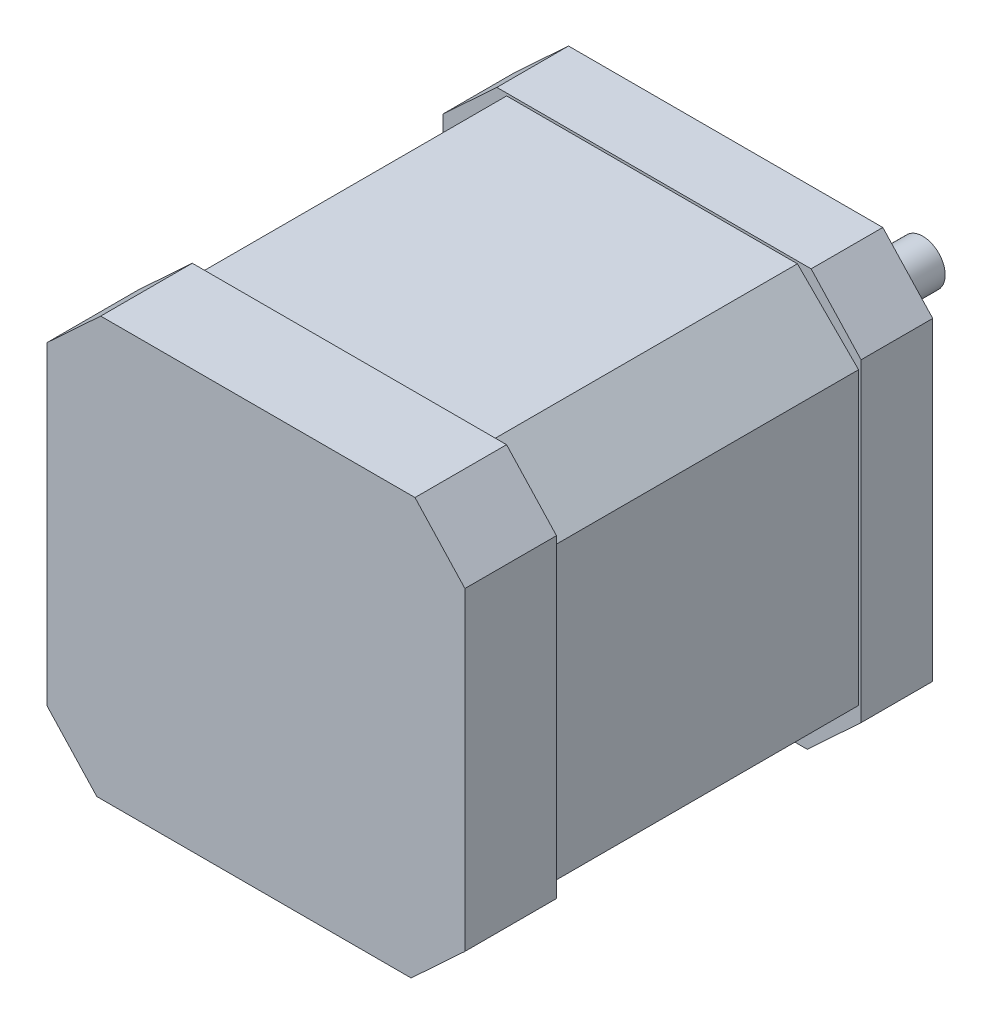
ISO-10303-21;
HEADER;
FILE_DESCRIPTION(('STEP AP214'),'2;1');
FILE_NAME('part.step','',(''),(''),'','','');
FILE_SCHEMA(('AUTOMOTIVE_DESIGN { 1 0 10303 214 1 1 1 1 }'));
ENDSEC;
DATA;
#1=APPLICATION_CONTEXT('core data for automotive mechanical design processes');
#2=APPLICATION_PROTOCOL_DEFINITION('international standard','automotive_design',2000,#1);
#3=PRODUCT_CONTEXT('',#1,'mechanical');
#4=PRODUCT('Part','Part','',(#3));
#5=PRODUCT_RELATED_PRODUCT_CATEGORY('part','',(#4));
#6=PRODUCT_DEFINITION_FORMATION('','',#4);
#7=PRODUCT_DEFINITION_CONTEXT('part definition',#1,'design');
#8=PRODUCT_DEFINITION('design','',#6,#7);
#9=PRODUCT_DEFINITION_SHAPE('','',#8);
#10=(LENGTH_UNIT() NAMED_UNIT(*) SI_UNIT(.MILLI.,.METRE.));
#11=(NAMED_UNIT(*) PLANE_ANGLE_UNIT() SI_UNIT($,.RADIAN.));
#12=(NAMED_UNIT(*) SI_UNIT($,.STERADIAN.) SOLID_ANGLE_UNIT());
#13=UNCERTAINTY_MEASURE_WITH_UNIT(LENGTH_MEASURE(1.E-05),#10,'distance_accuracy_value','');
#14=(GEOMETRIC_REPRESENTATION_CONTEXT(3) GLOBAL_UNCERTAINTY_ASSIGNED_CONTEXT((#13)) GLOBAL_UNIT_ASSIGNED_CONTEXT((#10,
#11,#12)) REPRESENTATION_CONTEXT('',''));
#15=CARTESIAN_POINT('',(0.,0.,0.));
#16=DIRECTION('',(0.,0.,1.));
#17=DIRECTION('',(1.,0.,0.));
#18=AXIS2_PLACEMENT_3D('',#15,#16,#17);
#19=CARTESIAN_POINT('',(21.,0.,47.));
#20=DIRECTION('',(1.,0.,0.));
#21=DIRECTION('',(0.,1.,0.));
#22=AXIS2_PLACEMENT_3D('',#19,#20,#21);
#23=PLANE('',#22);
#24=DIRECTION('',(0.,0.,-1.));
#25=VECTOR('',#24,1.);
#26=CARTESIAN_POINT('',(21.,-15.9841759962391,47.));
#27=LINE('',#26,#25);
#28=CARTESIAN_POINT('',(21.,-15.9841759962391,47.));
#29=VERTEX_POINT('',#28);
#30=CARTESIAN_POINT('',(21.,-15.9841759962391,37.8));
#31=VERTEX_POINT('',#30);
#32=EDGE_CURVE('E381',#29,#31,#27,.T.);
#33=ORIENTED_EDGE('',*,*,#32,.T.);
#34=DIRECTION('',(0.,1.,0.));
#35=VECTOR('',#34,1.);
#36=CARTESIAN_POINT('',(21.,0.,37.8));
#37=LINE('',#36,#35);
#38=CARTESIAN_POINT('',(21.,15.5921718725903,37.8));
#39=VERTEX_POINT('',#38);
#40=EDGE_CURVE('E108',#31,#39,#37,.T.);
#41=ORIENTED_EDGE('',*,*,#40,.T.);
#42=DIRECTION('',(0.,0.,-1.));
#43=VECTOR('',#42,1.);
#44=CARTESIAN_POINT('',(21.,15.5921718725903,47.));
#45=LINE('',#44,#43);
#46=CARTESIAN_POINT('',(21.,15.5921718725903,47.));
#47=VERTEX_POINT('',#46);
#48=EDGE_CURVE('E409',#47,#39,#45,.T.);
#49=ORIENTED_EDGE('',*,*,#48,.F.);
#50=DIRECTION('',(0.,-1.,0.));
#51=VECTOR('',#50,1.);
#52=CARTESIAN_POINT('',(21.,0.,47.));
#53=LINE('',#52,#51);
#54=EDGE_CURVE('E337',#47,#29,#53,.T.);
#55=ORIENTED_EDGE('',*,*,#54,.T.);
#56=EDGE_LOOP('',(#33,#41,#49,#55));
#57=FACE_BOUND('',#56,.T.);
#58=ADVANCED_FACE('F86',(#57),#23,.T.);
#59=CARTESIAN_POINT('',(19.0627004123154,17.6808781736177,47.));
#60=DIRECTION('',(-0.733180785089054,-0.680033775908373,0.));
#61=DIRECTION('',(0.680033775908373,-0.733180785089054,0.));
#62=AXIS2_PLACEMENT_3D('',#59,#60,#61);
#63=PLANE('',#62);
#64=DIRECTION('',(0.680033775908373,-0.733180785089054,0.));
#65=VECTOR('',#64,1.);
#66=CARTESIAN_POINT('',(19.0627004123154,17.6808781736177,37.8));
#67=LINE('',#66,#65);
#68=CARTESIAN_POINT('',(15.9841759962391,21.,37.8));
#69=VERTEX_POINT('',#68);
#70=EDGE_CURVE('E333',#69,#39,#67,.T.);
#71=ORIENTED_EDGE('',*,*,#70,.F.);
#72=DIRECTION('',(0.,0.,-1.));
#73=VECTOR('',#72,1.);
#74=CARTESIAN_POINT('',(15.9841759962391,21.,47.));
#75=LINE('',#74,#73);
#76=CARTESIAN_POINT('',(15.9841759962391,21.,47.));
#77=VERTEX_POINT('',#76);
#78=EDGE_CURVE('E405',#77,#69,#75,.T.);
#79=ORIENTED_EDGE('',*,*,#78,.F.);
#80=DIRECTION('',(-0.680033775908373,0.733180785089054,0.));
#81=VECTOR('',#80,1.);
#82=CARTESIAN_POINT('',(19.0627004123154,17.6808781736177,47.));
#83=LINE('',#82,#81);
#84=EDGE_CURVE('E340',#47,#77,#83,.T.);
#85=ORIENTED_EDGE('',*,*,#84,.F.);
#86=ORIENTED_EDGE('',*,*,#48,.T.);
#87=EDGE_LOOP('',(#71,#79,#85,#86));
#88=FACE_BOUND('',#87,.T.);
#89=ADVANCED_FACE('F481',(#88),#63,.F.);
#90=CARTESIAN_POINT('',(0.,21.,47.));
#91=DIRECTION('',(0.,1.,0.));
#92=DIRECTION('',(0.,0.,1.));
#93=AXIS2_PLACEMENT_3D('',#90,#91,#92);
#94=PLANE('',#93);
#95=ORIENTED_EDGE('',*,*,#78,.T.);
#96=DIRECTION('',(-1.,0.,0.));
#97=VECTOR('',#96,1.);
#98=CARTESIAN_POINT('',(0.,21.,37.8));
#99=LINE('',#98,#97);
#100=CARTESIAN_POINT('',(-15.5921718725903,21.,37.8));
#101=VERTEX_POINT('',#100);
#102=EDGE_CURVE('E330',#69,#101,#99,.T.);
#103=ORIENTED_EDGE('',*,*,#102,.T.);
#104=DIRECTION('',(0.,0.,-1.));
#105=VECTOR('',#104,1.);
#106=CARTESIAN_POINT('',(-15.5921718725903,21.,47.));
#107=LINE('',#106,#105);
#108=CARTESIAN_POINT('',(-15.5921718725903,21.,47.));
#109=VERTEX_POINT('',#108);
#110=EDGE_CURVE('E401',#109,#101,#107,.T.);
#111=ORIENTED_EDGE('',*,*,#110,.F.);
#112=DIRECTION('',(1.,0.,0.));
#113=VECTOR('',#112,1.);
#114=CARTESIAN_POINT('',(0.,21.,47.));
#115=LINE('',#114,#113);
#116=EDGE_CURVE('E343',#109,#77,#115,.T.);
#117=ORIENTED_EDGE('',*,*,#116,.T.);
#118=EDGE_LOOP('',(#95,#103,#111,#117));
#119=FACE_BOUND('',#118,.T.);
#120=ADVANCED_FACE('F487',(#119),#94,.T.);
#121=CARTESIAN_POINT('',(-17.6808781736177,19.0627004123154,47.));
#122=DIRECTION('',(-0.680033775908373,0.733180785089054,0.));
#123=DIRECTION('',(-0.733180785089054,-0.680033775908373,0.));
#124=AXIS2_PLACEMENT_3D('',#121,#122,#123);
#125=PLANE('',#124);
#126=ORIENTED_EDGE('',*,*,#110,.T.);
#127=DIRECTION('',(-0.733180785089054,-0.680033775908373,0.));
#128=VECTOR('',#127,1.);
#129=CARTESIAN_POINT('',(-17.6808781736177,19.0627004123154,37.8));
#130=LINE('',#129,#128);
#131=CARTESIAN_POINT('',(-21.,15.9841759962391,37.8));
#132=VERTEX_POINT('',#131);
#133=EDGE_CURVE('E327',#101,#132,#130,.T.);
#134=ORIENTED_EDGE('',*,*,#133,.T.);
#135=DIRECTION('',(0.,0.,-1.));
#136=VECTOR('',#135,1.);
#137=CARTESIAN_POINT('',(-21.,15.9841759962391,47.));
#138=LINE('',#137,#136);
#139=CARTESIAN_POINT('',(-21.,15.9841759962391,47.));
#140=VERTEX_POINT('',#139);
#141=EDGE_CURVE('E397',#140,#132,#138,.T.);
#142=ORIENTED_EDGE('',*,*,#141,.F.);
#143=DIRECTION('',(0.733180785089054,0.680033775908373,0.));
#144=VECTOR('',#143,1.);
#145=CARTESIAN_POINT('',(-17.6808781736177,19.0627004123154,47.));
#146=LINE('',#145,#144);
#147=EDGE_CURVE('E346',#140,#109,#146,.T.);
#148=ORIENTED_EDGE('',*,*,#147,.T.);
#149=EDGE_LOOP('',(#126,#134,#142,#148));
#150=FACE_BOUND('',#149,.T.);
#151=ADVANCED_FACE('F573',(#150),#125,.T.);
#152=CARTESIAN_POINT('',(-21.,0.,47.));
#153=DIRECTION('',(1.,0.,0.));
#154=DIRECTION('',(0.,1.,0.));
#155=AXIS2_PLACEMENT_3D('',#152,#153,#154);
#156=PLANE('',#155);
#157=DIRECTION('',(0.,1.,0.));
#158=VECTOR('',#157,1.);
#159=CARTESIAN_POINT('',(-21.,0.,37.8));
#160=LINE('',#159,#158);
#161=CARTESIAN_POINT('',(-21.,-15.5921718725903,37.8));
#162=VERTEX_POINT('',#161);
#163=EDGE_CURVE('E325',#162,#132,#160,.T.);
#164=ORIENTED_EDGE('',*,*,#163,.F.);
#165=DIRECTION('',(0.,0.,-1.));
#166=VECTOR('',#165,1.);
#167=CARTESIAN_POINT('',(-21.,-15.5921718725903,47.));
#168=LINE('',#167,#166);
#169=CARTESIAN_POINT('',(-21.,-15.5921718725903,47.));
#170=VERTEX_POINT('',#169);
#171=EDGE_CURVE('E393',#170,#162,#168,.T.);
#172=ORIENTED_EDGE('',*,*,#171,.F.);
#173=DIRECTION('',(0.,-1.,0.));
#174=VECTOR('',#173,1.);
#175=CARTESIAN_POINT('',(-21.,0.,47.));
#176=LINE('',#175,#174);
#177=EDGE_CURVE('E349',#140,#170,#176,.T.);
#178=ORIENTED_EDGE('',*,*,#177,.F.);
#179=ORIENTED_EDGE('',*,*,#141,.T.);
#180=EDGE_LOOP('',(#164,#172,#178,#179));
#181=FACE_BOUND('',#180,.T.);
#182=ADVANCED_FACE('F570',(#181),#156,.F.);
#183=CARTESIAN_POINT('',(-19.0627004123154,-17.6808781736177,47.));
#184=DIRECTION('',(-0.733180785089054,-0.680033775908373,0.));
#185=DIRECTION('',(0.680033775908373,-0.733180785089054,0.));
#186=AXIS2_PLACEMENT_3D('',#183,#184,#185);
#187=PLANE('',#186);
#188=ORIENTED_EDGE('',*,*,#171,.T.);
#189=DIRECTION('',(0.680033775908373,-0.733180785089054,0.));
#190=VECTOR('',#189,1.);
#191=CARTESIAN_POINT('',(-19.0627004123154,-17.6808781736177,37.8));
#192=LINE('',#191,#190);
#193=CARTESIAN_POINT('',(-15.9841759962391,-21.,37.8));
#194=VERTEX_POINT('',#193);
#195=EDGE_CURVE('E322',#162,#194,#192,.T.);
#196=ORIENTED_EDGE('',*,*,#195,.T.);
#197=DIRECTION('',(0.,0.,-1.));
#198=VECTOR('',#197,1.);
#199=CARTESIAN_POINT('',(-15.9841759962391,-21.,47.));
#200=LINE('',#199,#198);
#201=CARTESIAN_POINT('',(-15.9841759962391,-21.,47.));
#202=VERTEX_POINT('',#201);
#203=EDGE_CURVE('E389',#202,#194,#200,.T.);
#204=ORIENTED_EDGE('',*,*,#203,.F.);
#205=DIRECTION('',(-0.680033775908373,0.733180785089054,0.));
#206=VECTOR('',#205,1.);
#207=CARTESIAN_POINT('',(-19.0627004123154,-17.6808781736177,47.));
#208=LINE('',#207,#206);
#209=EDGE_CURVE('E351',#202,#170,#208,.T.);
#210=ORIENTED_EDGE('',*,*,#209,.T.);
#211=EDGE_LOOP('',(#188,#196,#204,#210));
#212=FACE_BOUND('',#211,.T.);
#213=ADVANCED_FACE('F553',(#212),#187,.T.);
#214=CARTESIAN_POINT('',(0.,-21.,47.));
#215=DIRECTION('',(0.,1.,0.));
#216=DIRECTION('',(0.,0.,1.));
#217=AXIS2_PLACEMENT_3D('',#214,#215,#216);
#218=PLANE('',#217);
#219=DIRECTION('',(-1.,0.,0.));
#220=VECTOR('',#219,1.);
#221=CARTESIAN_POINT('',(0.,-21.,37.8));
#222=LINE('',#221,#220);
#223=CARTESIAN_POINT('',(15.5921718725902,-21.,37.8));
#224=VERTEX_POINT('',#223);
#225=EDGE_CURVE('E320',#224,#194,#222,.T.);
#226=ORIENTED_EDGE('',*,*,#225,.F.);
#227=DIRECTION('',(0.,0.,-1.));
#228=VECTOR('',#227,1.);
#229=CARTESIAN_POINT('',(15.5921718725902,-21.,47.));
#230=LINE('',#229,#228);
#231=CARTESIAN_POINT('',(15.5921718725902,-21.,47.));
#232=VERTEX_POINT('',#231);
#233=EDGE_CURVE('E385',#232,#224,#230,.T.);
#234=ORIENTED_EDGE('',*,*,#233,.F.);
#235=DIRECTION('',(1.,0.,0.));
#236=VECTOR('',#235,1.);
#237=CARTESIAN_POINT('',(0.,-21.,47.));
#238=LINE('',#237,#236);
#239=EDGE_CURVE('E354',#202,#232,#238,.T.);
#240=ORIENTED_EDGE('',*,*,#239,.F.);
#241=ORIENTED_EDGE('',*,*,#203,.T.);
#242=EDGE_LOOP('',(#226,#234,#240,#241));
#243=FACE_BOUND('',#242,.T.);
#244=ADVANCED_FACE('F541',(#243),#218,.F.);
#245=CARTESIAN_POINT('',(17.6808781736177,-19.0627004123154,47.));
#246=DIRECTION('',(-0.680033775908373,0.733180785089054,0.));
#247=DIRECTION('',(-0.733180785089054,-0.680033775908373,0.));
#248=AXIS2_PLACEMENT_3D('',#245,#246,#247);
#249=PLANE('',#248);
#250=DIRECTION('',(-0.733180785089054,-0.680033775908373,0.));
#251=VECTOR('',#250,1.);
#252=CARTESIAN_POINT('',(17.6808781736177,-19.0627004123154,37.8));
#253=LINE('',#252,#251);
#254=EDGE_CURVE('E93',#31,#224,#253,.T.);
#255=ORIENTED_EDGE('',*,*,#254,.F.);
#256=ORIENTED_EDGE('',*,*,#32,.F.);
#257=DIRECTION('',(0.733180785089054,0.680033775908373,0.));
#258=VECTOR('',#257,1.);
#259=CARTESIAN_POINT('',(17.6808781736177,-19.0627004123154,47.));
#260=LINE('',#259,#258);
#261=EDGE_CURVE('E356',#232,#29,#260,.T.);
#262=ORIENTED_EDGE('',*,*,#261,.F.);
#263=ORIENTED_EDGE('',*,*,#233,.T.);
#264=EDGE_LOOP('',(#255,#256,#262,#263));
#265=FACE_BOUND('',#264,.T.);
#266=ADVANCED_FACE('F535',(#265),#249,.F.);
#267=CARTESIAN_POINT('',(0.,0.,47.));
#268=DIRECTION('',(0.,0.,1.));
#269=DIRECTION('',(1.,0.,0.));
#270=AXIS2_PLACEMENT_3D('',#267,#268,#269);
#271=PLANE('',#270);
#272=ORIENTED_EDGE('',*,*,#54,.F.);
#273=ORIENTED_EDGE('',*,*,#84,.T.);
#274=ORIENTED_EDGE('',*,*,#116,.F.);
#275=ORIENTED_EDGE('',*,*,#147,.F.);
#276=ORIENTED_EDGE('',*,*,#177,.T.);
#277=ORIENTED_EDGE('',*,*,#209,.F.);
#278=ORIENTED_EDGE('',*,*,#239,.T.);
#279=ORIENTED_EDGE('',*,*,#261,.T.);
#280=EDGE_LOOP('',(#272,#273,#274,#275,#276,#277,#278,#279));
#281=FACE_BOUND('',#280,.T.);
#282=ADVANCED_FACE('F545',(#281),#271,.T.);
#283=CARTESIAN_POINT('',(0.,0.,37.8));
#284=DIRECTION('',(0.,0.,-1.));
#285=DIRECTION('',(-1.,0.,0.));
#286=AXIS2_PLACEMENT_3D('',#283,#284,#285);
#287=PLANE('',#286);
#288=ORIENTED_EDGE('',*,*,#254,.T.);
#289=ORIENTED_EDGE('',*,*,#225,.T.);
#290=ORIENTED_EDGE('',*,*,#195,.F.);
#291=ORIENTED_EDGE('',*,*,#163,.T.);
#292=ORIENTED_EDGE('',*,*,#133,.F.);
#293=ORIENTED_EDGE('',*,*,#102,.F.);
#294=ORIENTED_EDGE('',*,*,#70,.T.);
#295=ORIENTED_EDGE('',*,*,#40,.F.);
#296=EDGE_LOOP('',(#288,#289,#290,#291,#292,#293,#294,#295));
#297=FACE_BOUND('',#296,.T.);
#298=DIRECTION('',(-0.707106781186548,0.707106781186547,0.));
#299=VECTOR('',#298,1.);
#300=CARTESIAN_POINT('',(17.6776695296637,17.6776695296637,37.8));
#301=LINE('',#300,#299);
#302=CARTESIAN_POINT('',(20.75,14.6053390593274,37.8));
#303=VERTEX_POINT('',#302);
#304=CARTESIAN_POINT('',(14.6053390593274,20.75,37.8));
#305=VERTEX_POINT('',#304);
#306=EDGE_CURVE('E250',#303,#305,#301,.T.);
#307=ORIENTED_EDGE('',*,*,#306,.T.);
#308=DIRECTION('',(1.,0.,0.));
#309=VECTOR('',#308,1.);
#310=CARTESIAN_POINT('',(0.,20.75,37.8));
#311=LINE('',#310,#309);
#312=CARTESIAN_POINT('',(-14.6053390593274,20.75,37.8));
#313=VERTEX_POINT('',#312);
#314=EDGE_CURVE('E264',#313,#305,#311,.T.);
#315=ORIENTED_EDGE('',*,*,#314,.F.);
#316=DIRECTION('',(0.707106781186547,0.707106781186548,0.));
#317=VECTOR('',#316,1.);
#318=CARTESIAN_POINT('',(-17.6776695296637,17.6776695296637,37.8));
#319=LINE('',#318,#317);
#320=CARTESIAN_POINT('',(-20.75,14.6053390593274,37.8));
#321=VERTEX_POINT('',#320);
#322=EDGE_CURVE('E272',#321,#313,#319,.T.);
#323=ORIENTED_EDGE('',*,*,#322,.F.);
#324=DIRECTION('',(0.,1.,0.));
#325=VECTOR('',#324,1.);
#326=CARTESIAN_POINT('',(-20.75,0.,37.8));
#327=LINE('',#326,#325);
#328=CARTESIAN_POINT('',(-20.75,-14.6053390593274,37.8));
#329=VERTEX_POINT('',#328);
#330=EDGE_CURVE('E274',#329,#321,#327,.T.);
#331=ORIENTED_EDGE('',*,*,#330,.F.);
#332=DIRECTION('',(-0.707106781186547,0.707106781186548,0.));
#333=VECTOR('',#332,1.);
#334=CARTESIAN_POINT('',(-17.6776695296637,-17.6776695296637,37.8));
#335=LINE('',#334,#333);
#336=CARTESIAN_POINT('',(-14.6053390593274,-20.75,37.8));
#337=VERTEX_POINT('',#336);
#338=EDGE_CURVE('E280',#337,#329,#335,.T.);
#339=ORIENTED_EDGE('',*,*,#338,.F.);
#340=DIRECTION('',(1.,0.,0.));
#341=VECTOR('',#340,1.);
#342=CARTESIAN_POINT('',(0.,-20.75,37.8));
#343=LINE('',#342,#341);
#344=CARTESIAN_POINT('',(14.6053390593274,-20.75,37.8));
#345=VERTEX_POINT('',#344);
#346=EDGE_CURVE('E283',#337,#345,#343,.T.);
#347=ORIENTED_EDGE('',*,*,#346,.T.);
#348=DIRECTION('',(0.707106781186547,0.707106781186548,0.));
#349=VECTOR('',#348,1.);
#350=CARTESIAN_POINT('',(17.6776695296637,-17.6776695296637,37.8));
#351=LINE('',#350,#349);
#352=CARTESIAN_POINT('',(20.75,-14.6053390593274,37.8));
#353=VERTEX_POINT('',#352);
#354=EDGE_CURVE('E286',#345,#353,#351,.T.);
#355=ORIENTED_EDGE('',*,*,#354,.T.);
#356=DIRECTION('',(0.,1.,0.));
#357=VECTOR('',#356,1.);
#358=CARTESIAN_POINT('',(20.75,0.,37.8));
#359=LINE('',#358,#357);
#360=EDGE_CURVE('E268',#353,#303,#359,.T.);
#361=ORIENTED_EDGE('',*,*,#360,.T.);
#362=EDGE_LOOP('',(#307,#315,#323,#331,#339,#347,#355,#361));
#363=FACE_BOUND('',#362,.T.);
#364=ADVANCED_FACE('F262',(#297,#363),#287,.T.);
#365=CARTESIAN_POINT('',(17.6776695296637,17.6776695296637,-86.9741340859454));
#366=DIRECTION('',(0.707106781186547,0.707106781186548,0.));
#367=DIRECTION('',(-0.707106781186548,0.707106781186547,0.));
#368=AXIS2_PLACEMENT_3D('',#365,#366,#367);
#369=PLANE('',#368);
#370=DIRECTION('',(0.,0.,1.));
#371=VECTOR('',#370,1.);
#372=CARTESIAN_POINT('',(14.6053390593274,20.75,-86.9741340859454));
#373=LINE('',#372,#371);
#374=CARTESIAN_POINT('',(14.6053390593274,20.75,7.2));
#375=VERTEX_POINT('',#374);
#376=EDGE_CURVE('E246',#375,#305,#373,.T.);
#377=ORIENTED_EDGE('',*,*,#376,.T.);
#378=ORIENTED_EDGE('',*,*,#306,.F.);
#379=DIRECTION('',(0.,0.,1.));
#380=VECTOR('',#379,1.);
#381=CARTESIAN_POINT('',(20.75,14.6053390593274,-86.9741340859454));
#382=LINE('',#381,#380);
#383=CARTESIAN_POINT('',(20.75,14.6053390593274,7.2));
#384=VERTEX_POINT('',#383);
#385=EDGE_CURVE('E257',#384,#303,#382,.T.);
#386=ORIENTED_EDGE('',*,*,#385,.F.);
#387=DIRECTION('',(0.707106781186548,-0.707106781186547,0.));
#388=VECTOR('',#387,1.);
#389=CARTESIAN_POINT('',(17.6776695296637,17.6776695296637,7.2));
#390=LINE('',#389,#388);
#391=EDGE_CURVE('E252',#375,#384,#390,.T.);
#392=ORIENTED_EDGE('',*,*,#391,.F.);
#393=EDGE_LOOP('',(#377,#378,#386,#392));
#394=FACE_BOUND('',#393,.T.);
#395=ADVANCED_FACE('F248',(#394),#369,.T.);
#396=CARTESIAN_POINT('',(0.,20.75,-86.9741340859454));
#397=DIRECTION('',(0.,-1.,0.));
#398=DIRECTION('',(0.,0.,-1.));
#399=AXIS2_PLACEMENT_3D('',#396,#397,#398);
#400=PLANE('',#399);
#401=DIRECTION('',(-1.,0.,0.));
#402=VECTOR('',#401,1.);
#403=CARTESIAN_POINT('',(0.,20.75,7.2));
#404=LINE('',#403,#402);
#405=CARTESIAN_POINT('',(-14.6053390593274,20.75,7.2));
#406=VERTEX_POINT('',#405);
#407=EDGE_CURVE('E304',#375,#406,#404,.T.);
#408=ORIENTED_EDGE('',*,*,#407,.T.);
#409=DIRECTION('',(0.,0.,1.));
#410=VECTOR('',#409,1.);
#411=CARTESIAN_POINT('',(-14.6053390593274,20.75,-86.9741340859454));
#412=LINE('',#411,#410);
#413=EDGE_CURVE('E256',#406,#313,#412,.T.);
#414=ORIENTED_EDGE('',*,*,#413,.T.);
#415=ORIENTED_EDGE('',*,*,#314,.T.);
#416=ORIENTED_EDGE('',*,*,#376,.F.);
#417=EDGE_LOOP('',(#408,#414,#415,#416));
#418=FACE_BOUND('',#417,.T.);
#419=ADVANCED_FACE('F270',(#418),#400,.F.);
#420=CARTESIAN_POINT('',(-17.6776695296637,17.6776695296637,-86.9741340859454));
#421=DIRECTION('',(0.707106781186548,-0.707106781186547,0.));
#422=DIRECTION('',(0.707106781186547,0.707106781186548,0.));
#423=AXIS2_PLACEMENT_3D('',#420,#421,#422);
#424=PLANE('',#423);
#425=DIRECTION('',(-0.707106781186547,-0.707106781186548,0.));
#426=VECTOR('',#425,1.);
#427=CARTESIAN_POINT('',(-17.6776695296637,17.6776695296637,7.2));
#428=LINE('',#427,#426);
#429=CARTESIAN_POINT('',(-20.75,14.6053390593274,7.2));
#430=VERTEX_POINT('',#429);
#431=EDGE_CURVE('E433',#406,#430,#428,.T.);
#432=ORIENTED_EDGE('',*,*,#431,.T.);
#433=DIRECTION('',(0.,0.,1.));
#434=VECTOR('',#433,1.);
#435=CARTESIAN_POINT('',(-20.75,14.6053390593274,-86.9741340859454));
#436=LINE('',#435,#434);
#437=EDGE_CURVE('E296',#430,#321,#436,.T.);
#438=ORIENTED_EDGE('',*,*,#437,.T.);
#439=ORIENTED_EDGE('',*,*,#322,.T.);
#440=ORIENTED_EDGE('',*,*,#413,.F.);
#441=EDGE_LOOP('',(#432,#438,#439,#440));
#442=FACE_BOUND('',#441,.T.);
#443=ADVANCED_FACE('F471',(#442),#424,.F.);
#444=CARTESIAN_POINT('',(-20.75,0.,-86.9741340859454));
#445=DIRECTION('',(1.,0.,0.));
#446=DIRECTION('',(0.,0.,-1.));
#447=AXIS2_PLACEMENT_3D('',#444,#445,#446);
#448=PLANE('',#447);
#449=DIRECTION('',(0.,-1.,0.));
#450=VECTOR('',#449,1.);
#451=CARTESIAN_POINT('',(-20.75,0.,7.2));
#452=LINE('',#451,#450);
#453=CARTESIAN_POINT('',(-20.75,-14.6053390593274,7.2));
#454=VERTEX_POINT('',#453);
#455=EDGE_CURVE('E435',#430,#454,#452,.T.);
#456=ORIENTED_EDGE('',*,*,#455,.T.);
#457=DIRECTION('',(0.,0.,1.));
#458=VECTOR('',#457,1.);
#459=CARTESIAN_POINT('',(-20.75,-14.6053390593274,-86.9741340859454));
#460=LINE('',#459,#458);
#461=EDGE_CURVE('E294',#454,#329,#460,.T.);
#462=ORIENTED_EDGE('',*,*,#461,.T.);
#463=ORIENTED_EDGE('',*,*,#330,.T.);
#464=ORIENTED_EDGE('',*,*,#437,.F.);
#465=EDGE_LOOP('',(#456,#462,#463,#464));
#466=FACE_BOUND('',#465,.T.);
#467=ADVANCED_FACE('F468',(#466),#448,.F.);
#468=CARTESIAN_POINT('',(-17.6776695296637,-17.6776695296637,-86.9741340859454));
#469=DIRECTION('',(0.707106781186548,0.707106781186547,0.));
#470=DIRECTION('',(-0.707106781186547,0.707106781186548,0.));
#471=AXIS2_PLACEMENT_3D('',#468,#469,#470);
#472=PLANE('',#471);
#473=DIRECTION('',(0.707106781186547,-0.707106781186548,0.));
#474=VECTOR('',#473,1.);
#475=CARTESIAN_POINT('',(-17.6776695296637,-17.6776695296637,7.2));
#476=LINE('',#475,#474);
#477=CARTESIAN_POINT('',(-14.6053390593274,-20.75,7.2));
#478=VERTEX_POINT('',#477);
#479=EDGE_CURVE('E437',#454,#478,#476,.T.);
#480=ORIENTED_EDGE('',*,*,#479,.T.);
#481=DIRECTION('',(0.,0.,1.));
#482=VECTOR('',#481,1.);
#483=CARTESIAN_POINT('',(-14.6053390593274,-20.75,-86.9741340859454));
#484=LINE('',#483,#482);
#485=EDGE_CURVE('E292',#478,#337,#484,.T.);
#486=ORIENTED_EDGE('',*,*,#485,.T.);
#487=ORIENTED_EDGE('',*,*,#338,.T.);
#488=ORIENTED_EDGE('',*,*,#461,.F.);
#489=EDGE_LOOP('',(#480,#486,#487,#488));
#490=FACE_BOUND('',#489,.T.);
#491=ADVANCED_FACE('F466',(#490),#472,.F.);
#492=CARTESIAN_POINT('',(0.,-20.75,-86.9741340859454));
#493=DIRECTION('',(0.,-1.,0.));
#494=DIRECTION('',(0.,0.,-1.));
#495=AXIS2_PLACEMENT_3D('',#492,#493,#494);
#496=PLANE('',#495);
#497=DIRECTION('',(0.,0.,1.));
#498=VECTOR('',#497,1.);
#499=CARTESIAN_POINT('',(14.6053390593274,-20.75,-86.9741340859454));
#500=LINE('',#499,#498);
#501=CARTESIAN_POINT('',(14.6053390593274,-20.75,7.2));
#502=VERTEX_POINT('',#501);
#503=EDGE_CURVE('E290',#502,#345,#500,.T.);
#504=ORIENTED_EDGE('',*,*,#503,.T.);
#505=ORIENTED_EDGE('',*,*,#346,.F.);
#506=ORIENTED_EDGE('',*,*,#485,.F.);
#507=DIRECTION('',(-1.,0.,0.));
#508=VECTOR('',#507,1.);
#509=CARTESIAN_POINT('',(0.,-20.75,7.2));
#510=LINE('',#509,#508);
#511=EDGE_CURVE('E439',#502,#478,#510,.T.);
#512=ORIENTED_EDGE('',*,*,#511,.F.);
#513=EDGE_LOOP('',(#504,#505,#506,#512));
#514=FACE_BOUND('',#513,.T.);
#515=ADVANCED_FACE('F460',(#514),#496,.T.);
#516=CARTESIAN_POINT('',(17.6776695296637,-17.6776695296637,-86.9741340859454));
#517=DIRECTION('',(0.707106781186548,-0.707106781186547,0.));
#518=DIRECTION('',(0.707106781186547,0.707106781186548,0.));
#519=AXIS2_PLACEMENT_3D('',#516,#517,#518);
#520=PLANE('',#519);
#521=DIRECTION('',(0.,0.,1.));
#522=VECTOR('',#521,1.);
#523=CARTESIAN_POINT('',(20.75,-14.6053390593274,-86.9741340859454));
#524=LINE('',#523,#522);
#525=CARTESIAN_POINT('',(20.75,-14.6053390593274,7.2));
#526=VERTEX_POINT('',#525);
#527=EDGE_CURVE('E288',#526,#353,#524,.T.);
#528=ORIENTED_EDGE('',*,*,#527,.T.);
#529=ORIENTED_EDGE('',*,*,#354,.F.);
#530=ORIENTED_EDGE('',*,*,#503,.F.);
#531=DIRECTION('',(-0.707106781186547,-0.707106781186548,0.));
#532=VECTOR('',#531,1.);
#533=CARTESIAN_POINT('',(17.6776695296637,-17.6776695296637,7.2));
#534=LINE('',#533,#532);
#535=EDGE_CURVE('E442',#526,#502,#534,.T.);
#536=ORIENTED_EDGE('',*,*,#535,.F.);
#537=EDGE_LOOP('',(#528,#529,#530,#536));
#538=FACE_BOUND('',#537,.T.);
#539=ADVANCED_FACE('F453',(#538),#520,.T.);
#540=CARTESIAN_POINT('',(20.75,0.,-86.9741340859454));
#541=DIRECTION('',(1.,0.,0.));
#542=DIRECTION('',(0.,0.,-1.));
#543=AXIS2_PLACEMENT_3D('',#540,#541,#542);
#544=PLANE('',#543);
#545=ORIENTED_EDGE('',*,*,#385,.T.);
#546=ORIENTED_EDGE('',*,*,#360,.F.);
#547=ORIENTED_EDGE('',*,*,#527,.F.);
#548=DIRECTION('',(0.,-1.,0.));
#549=VECTOR('',#548,1.);
#550=CARTESIAN_POINT('',(20.75,0.,7.2));
#551=LINE('',#550,#549);
#552=EDGE_CURVE('E301',#384,#526,#551,.T.);
#553=ORIENTED_EDGE('',*,*,#552,.F.);
#554=EDGE_LOOP('',(#545,#546,#547,#553));
#555=FACE_BOUND('',#554,.T.);
#556=ADVANCED_FACE('F450',(#555),#544,.T.);
#557=CARTESIAN_POINT('',(0.,0.,7.2));
#558=DIRECTION('',(0.,0.,1.));
#559=DIRECTION('',(1.,0.,0.));
#560=AXIS2_PLACEMENT_3D('',#557,#558,#559);
#561=PLANE('',#560);
#562=DIRECTION('',(-0.680033775908373,0.733180785089054,0.));
#563=VECTOR('',#562,1.);
#564=CARTESIAN_POINT('',(19.0627004123154,17.6808781736177,7.2));
#565=LINE('',#564,#563);
#566=CARTESIAN_POINT('',(21.,15.5921718725903,7.2));
#567=VERTEX_POINT('',#566);
#568=CARTESIAN_POINT('',(15.9841759962391,21.,7.2));
#569=VERTEX_POINT('',#568);
#570=EDGE_CURVE('E315',#567,#569,#565,.T.);
#571=ORIENTED_EDGE('',*,*,#570,.T.);
#572=DIRECTION('',(1.,0.,0.));
#573=VECTOR('',#572,1.);
#574=CARTESIAN_POINT('',(0.,21.,7.2));
#575=LINE('',#574,#573);
#576=CARTESIAN_POINT('',(-15.5921718725903,21.,7.2));
#577=VERTEX_POINT('',#576);
#578=EDGE_CURVE('E312',#577,#569,#575,.T.);
#579=ORIENTED_EDGE('',*,*,#578,.F.);
#580=DIRECTION('',(0.733180785089054,0.680033775908373,0.));
#581=VECTOR('',#580,1.);
#582=CARTESIAN_POINT('',(-17.6808781736177,19.0627004123154,7.2));
#583=LINE('',#582,#581);
#584=CARTESIAN_POINT('',(-21.,15.9841759962391,7.2));
#585=VERTEX_POINT('',#584);
#586=EDGE_CURVE('E309',#585,#577,#583,.T.);
#587=ORIENTED_EDGE('',*,*,#586,.F.);
#588=DIRECTION('',(0.,-1.,0.));
#589=VECTOR('',#588,1.);
#590=CARTESIAN_POINT('',(-21.,0.,7.2));
#591=LINE('',#590,#589);
#592=CARTESIAN_POINT('',(-21.,-15.5921718725903,7.2));
#593=VERTEX_POINT('',#592);
#594=EDGE_CURVE('E307',#585,#593,#591,.T.);
#595=ORIENTED_EDGE('',*,*,#594,.T.);
#596=DIRECTION('',(-0.680033775908373,0.733180785089054,0.));
#597=VECTOR('',#596,1.);
#598=CARTESIAN_POINT('',(-19.0627004123154,-17.6808781736177,7.2));
#599=LINE('',#598,#597);
#600=CARTESIAN_POINT('',(-15.9841759962391,-21.,7.2));
#601=VERTEX_POINT('',#600);
#602=EDGE_CURVE('E303',#601,#593,#599,.T.);
#603=ORIENTED_EDGE('',*,*,#602,.F.);
#604=DIRECTION('',(1.,0.,0.));
#605=VECTOR('',#604,1.);
#606=CARTESIAN_POINT('',(0.,-21.,7.2));
#607=LINE('',#606,#605);
#608=CARTESIAN_POINT('',(15.5921718725902,-21.,7.2));
#609=VERTEX_POINT('',#608);
#610=EDGE_CURVE('E100',#601,#609,#607,.T.);
#611=ORIENTED_EDGE('',*,*,#610,.T.);
#612=DIRECTION('',(0.733180785089054,0.680033775908373,0.));
#613=VECTOR('',#612,1.);
#614=CARTESIAN_POINT('',(17.6808781736177,-19.0627004123154,7.2));
#615=LINE('',#614,#613);
#616=CARTESIAN_POINT('',(21.,-15.9841759962391,7.2));
#617=VERTEX_POINT('',#616);
#618=EDGE_CURVE('E412',#609,#617,#615,.T.);
#619=ORIENTED_EDGE('',*,*,#618,.T.);
#620=DIRECTION('',(0.,-1.,0.));
#621=VECTOR('',#620,1.);
#622=CARTESIAN_POINT('',(21.,0.,7.2));
#623=LINE('',#622,#621);
#624=EDGE_CURVE('E317',#567,#617,#623,.T.);
#625=ORIENTED_EDGE('',*,*,#624,.F.);
#626=EDGE_LOOP('',(#571,#579,#587,#595,#603,#611,#619,#625));
#627=FACE_BOUND('',#626,.T.);
#628=ORIENTED_EDGE('',*,*,#391,.T.);
#629=ORIENTED_EDGE('',*,*,#552,.T.);
#630=ORIENTED_EDGE('',*,*,#535,.T.);
#631=ORIENTED_EDGE('',*,*,#511,.T.);
#632=ORIENTED_EDGE('',*,*,#479,.F.);
#633=ORIENTED_EDGE('',*,*,#455,.F.);
#634=ORIENTED_EDGE('',*,*,#431,.F.);
#635=ORIENTED_EDGE('',*,*,#407,.F.);
#636=EDGE_LOOP('',(#628,#629,#630,#631,#632,#633,#634,#635));
#637=FACE_BOUND('',#636,.T.);
#638=ADVANCED_FACE('F447',(#627,#637),#561,.T.);
#639=CARTESIAN_POINT('',(0.,0.,0.));
#640=DIRECTION('',(0.,0.,1.));
#641=DIRECTION('',(1.,0.,0.));
#642=AXIS2_PLACEMENT_3D('',#639,#640,#641);
#643=PLANE('',#642);
#644=CARTESIAN_POINT('',(15.5,-15.5,0.));
#645=DIRECTION('',(0.,0.,-1.));
#646=DIRECTION('',(-1.,0.,0.));
#647=AXIS2_PLACEMENT_3D('',#644,#645,#646);
#648=CIRCLE('',#647,1.5);
#649=CARTESIAN_POINT('',(14.,-15.5,0.));
#650=VERTEX_POINT('',#649);
#651=EDGE_CURVE('E877',#650,#650,#648,.T.);
#652=ORIENTED_EDGE('',*,*,#651,.F.);
#653=EDGE_LOOP('',(#652));
#654=FACE_BOUND('',#653,.T.);
#655=CARTESIAN_POINT('',(15.5,15.5,0.));
#656=DIRECTION('',(0.,0.,-1.));
#657=DIRECTION('',(-1.,0.,0.));
#658=AXIS2_PLACEMENT_3D('',#655,#656,#657);
#659=CIRCLE('',#658,1.5);
#660=CARTESIAN_POINT('',(14.,15.5,0.));
#661=VERTEX_POINT('',#660);
#662=EDGE_CURVE('E886',#661,#661,#659,.T.);
#663=ORIENTED_EDGE('',*,*,#662,.F.);
#664=EDGE_LOOP('',(#663));
#665=FACE_BOUND('',#664,.T.);
#666=CARTESIAN_POINT('',(-15.5,15.5,0.));
#667=DIRECTION('',(0.,0.,-1.));
#668=DIRECTION('',(-1.,0.,0.));
#669=AXIS2_PLACEMENT_3D('',#666,#667,#668);
#670=CIRCLE('',#669,1.5);
#671=CARTESIAN_POINT('',(-17.,15.5,0.));
#672=VERTEX_POINT('',#671);
#673=EDGE_CURVE('E892',#672,#672,#670,.T.);
#674=ORIENTED_EDGE('',*,*,#673,.F.);
#675=EDGE_LOOP('',(#674));
#676=FACE_BOUND('',#675,.T.);
#677=CARTESIAN_POINT('',(-15.5,-15.5,0.));
#678=DIRECTION('',(0.,0.,-1.));
#679=DIRECTION('',(-1.,0.,0.));
#680=AXIS2_PLACEMENT_3D('',#677,#678,#679);
#681=CIRCLE('',#680,1.5);
#682=CARTESIAN_POINT('',(-17.,-15.5,0.));
#683=VERTEX_POINT('',#682);
#684=EDGE_CURVE('E428',#683,#683,#681,.T.);
#685=ORIENTED_EDGE('',*,*,#684,.F.);
#686=EDGE_LOOP('',(#685));
#687=FACE_BOUND('',#686,.T.);
#688=CARTESIAN_POINT('',(0.,0.,0.));
#689=DIRECTION('',(0.,0.,1.));
#690=DIRECTION('',(1.,0.,0.));
#691=AXIS2_PLACEMENT_3D('',#688,#689,#690);
#692=CIRCLE('',#691,10.);
#693=CARTESIAN_POINT('',(10.,0.,0.));
#694=VERTEX_POINT('',#693);
#695=EDGE_CURVE('E13',#694,#694,#692,.F.);
#696=ORIENTED_EDGE('',*,*,#695,.F.);
#697=EDGE_LOOP('',(#696));
#698=FACE_BOUND('',#697,.T.);
#699=DIRECTION('',(0.,-1.,0.));
#700=VECTOR('',#699,1.);
#701=CARTESIAN_POINT('',(21.,0.,0.));
#702=LINE('',#701,#700);
#703=CARTESIAN_POINT('',(21.,15.5921718725903,0.));
#704=VERTEX_POINT('',#703);
#705=CARTESIAN_POINT('',(21.,-15.9841759962391,0.));
#706=VERTEX_POINT('',#705);
#707=EDGE_CURVE('E336',#704,#706,#702,.T.);
#708=ORIENTED_EDGE('',*,*,#707,.T.);
#709=DIRECTION('',(0.733180785089054,0.680033775908373,0.));
#710=VECTOR('',#709,1.);
#711=CARTESIAN_POINT('',(17.6808781736177,-19.0627004123154,0.));
#712=LINE('',#711,#710);
#713=CARTESIAN_POINT('',(15.5921718725902,-21.,0.));
#714=VERTEX_POINT('',#713);
#715=EDGE_CURVE('E341',#714,#706,#712,.T.);
#716=ORIENTED_EDGE('',*,*,#715,.F.);
#717=DIRECTION('',(1.,0.,0.));
#718=VECTOR('',#717,1.);
#719=CARTESIAN_POINT('',(0.,-21.,0.));
#720=LINE('',#719,#718);
#721=CARTESIAN_POINT('',(-15.9841759962391,-21.,0.));
#722=VERTEX_POINT('',#721);
#723=EDGE_CURVE('E376',#722,#714,#720,.T.);
#724=ORIENTED_EDGE('',*,*,#723,.F.);
#725=DIRECTION('',(-0.680033775908373,0.733180785089054,0.));
#726=VECTOR('',#725,1.);
#727=CARTESIAN_POINT('',(-19.0627004123154,-17.6808781736177,0.));
#728=LINE('',#727,#726);
#729=CARTESIAN_POINT('',(-21.,-15.5921718725903,0.));
#730=VERTEX_POINT('',#729);
#731=EDGE_CURVE('E373',#722,#730,#728,.T.);
#732=ORIENTED_EDGE('',*,*,#731,.T.);
#733=DIRECTION('',(0.,-1.,0.));
#734=VECTOR('',#733,1.);
#735=CARTESIAN_POINT('',(-21.,0.,0.));
#736=LINE('',#735,#734);
#737=CARTESIAN_POINT('',(-21.,15.9841759962391,0.));
#738=VERTEX_POINT('',#737);
#739=EDGE_CURVE('E370',#738,#730,#736,.T.);
#740=ORIENTED_EDGE('',*,*,#739,.F.);
#741=DIRECTION('',(0.733180785089054,0.680033775908373,0.));
#742=VECTOR('',#741,1.);
#743=CARTESIAN_POINT('',(-17.6808781736177,19.0627004123154,0.));
#744=LINE('',#743,#742);
#745=CARTESIAN_POINT('',(-15.5921718725903,21.,0.));
#746=VERTEX_POINT('',#745);
#747=EDGE_CURVE('E367',#738,#746,#744,.T.);
#748=ORIENTED_EDGE('',*,*,#747,.T.);
#749=DIRECTION('',(1.,0.,0.));
#750=VECTOR('',#749,1.);
#751=CARTESIAN_POINT('',(0.,21.,0.));
#752=LINE('',#751,#750);
#753=CARTESIAN_POINT('',(15.9841759962391,21.,0.));
#754=VERTEX_POINT('',#753);
#755=EDGE_CURVE('E364',#746,#754,#752,.T.);
#756=ORIENTED_EDGE('',*,*,#755,.T.);
#757=DIRECTION('',(-0.680033775908373,0.733180785089054,0.));
#758=VECTOR('',#757,1.);
#759=CARTESIAN_POINT('',(19.0627004123154,17.6808781736177,0.));
#760=LINE('',#759,#758);
#761=EDGE_CURVE('E361',#704,#754,#760,.T.);
#762=ORIENTED_EDGE('',*,*,#761,.F.);
#763=EDGE_LOOP('',(#708,#716,#724,#732,#740,#748,#756,#762));
#764=FACE_BOUND('',#763,.T.);
#765=ADVANCED_FACE('F509',(#654,#665,#676,#687,#698,#764),#643,.F.);
#766=ORIENTED_EDGE('',*,*,#618,.F.);
#767=EDGE_CURVE('E384',#609,#714,#230,.T.);
#768=ORIENTED_EDGE('',*,*,#767,.T.);
#769=ORIENTED_EDGE('',*,*,#715,.T.);
#770=EDGE_CURVE('E358',#617,#706,#27,.T.);
#771=ORIENTED_EDGE('',*,*,#770,.F.);
#772=EDGE_LOOP('',(#766,#768,#769,#771));
#773=FACE_BOUND('',#772,.T.);
#774=ADVANCED_FACE('F532',(#773),#249,.F.);
#775=ORIENTED_EDGE('',*,*,#610,.F.);
#776=EDGE_CURVE('E388',#601,#722,#200,.T.);
#777=ORIENTED_EDGE('',*,*,#776,.T.);
#778=ORIENTED_EDGE('',*,*,#723,.T.);
#779=ORIENTED_EDGE('',*,*,#767,.F.);
#780=EDGE_LOOP('',(#775,#777,#778,#779));
#781=FACE_BOUND('',#780,.T.);
#782=ADVANCED_FACE('F530',(#781),#218,.F.);
#783=ORIENTED_EDGE('',*,*,#776,.F.);
#784=ORIENTED_EDGE('',*,*,#602,.T.);
#785=EDGE_CURVE('E392',#593,#730,#168,.T.);
#786=ORIENTED_EDGE('',*,*,#785,.T.);
#787=ORIENTED_EDGE('',*,*,#731,.F.);
#788=EDGE_LOOP('',(#783,#784,#786,#787));
#789=FACE_BOUND('',#788,.T.);
#790=ADVANCED_FACE('F527',(#789),#187,.T.);
#791=ORIENTED_EDGE('',*,*,#594,.F.);
#792=EDGE_CURVE('E396',#585,#738,#138,.T.);
#793=ORIENTED_EDGE('',*,*,#792,.T.);
#794=ORIENTED_EDGE('',*,*,#739,.T.);
#795=ORIENTED_EDGE('',*,*,#785,.F.);
#796=EDGE_LOOP('',(#791,#793,#794,#795));
#797=FACE_BOUND('',#796,.T.);
#798=ADVANCED_FACE('F521',(#797),#156,.F.);
#799=ORIENTED_EDGE('',*,*,#792,.F.);
#800=ORIENTED_EDGE('',*,*,#586,.T.);
#801=EDGE_CURVE('E400',#577,#746,#107,.T.);
#802=ORIENTED_EDGE('',*,*,#801,.T.);
#803=ORIENTED_EDGE('',*,*,#747,.F.);
#804=EDGE_LOOP('',(#799,#800,#802,#803));
#805=FACE_BOUND('',#804,.T.);
#806=ADVANCED_FACE('F519',(#805),#125,.T.);
#807=ORIENTED_EDGE('',*,*,#801,.F.);
#808=ORIENTED_EDGE('',*,*,#578,.T.);
#809=EDGE_CURVE('E404',#569,#754,#75,.T.);
#810=ORIENTED_EDGE('',*,*,#809,.T.);
#811=ORIENTED_EDGE('',*,*,#755,.F.);
#812=EDGE_LOOP('',(#807,#808,#810,#811));
#813=FACE_BOUND('',#812,.T.);
#814=ADVANCED_FACE('F500',(#813),#94,.T.);
#815=ORIENTED_EDGE('',*,*,#570,.F.);
#816=EDGE_CURVE('E408',#567,#704,#45,.T.);
#817=ORIENTED_EDGE('',*,*,#816,.T.);
#818=ORIENTED_EDGE('',*,*,#761,.T.);
#819=ORIENTED_EDGE('',*,*,#809,.F.);
#820=EDGE_LOOP('',(#815,#817,#818,#819));
#821=FACE_BOUND('',#820,.T.);
#822=ADVANCED_FACE('F489',(#821),#63,.F.);
#823=ORIENTED_EDGE('',*,*,#816,.F.);
#824=ORIENTED_EDGE('',*,*,#624,.T.);
#825=ORIENTED_EDGE('',*,*,#770,.T.);
#826=ORIENTED_EDGE('',*,*,#707,.F.);
#827=EDGE_LOOP('',(#823,#824,#825,#826));
#828=FACE_BOUND('',#827,.T.);
#829=ADVANCED_FACE('F483',(#828),#23,.T.);
#830=CARTESIAN_POINT('',(0.,0.,-2.));
#831=DIRECTION('',(0.,0.,1.));
#832=DIRECTION('',(1.,0.,0.));
#833=AXIS2_PLACEMENT_3D('',#830,#831,#832);
#834=CYLINDRICAL_SURFACE('',#833,10.);
#835=CARTESIAN_POINT('',(0.,0.,-2.));
#836=DIRECTION('',(0.,0.,-1.));
#837=DIRECTION('',(-1.,0.,0.));
#838=AXIS2_PLACEMENT_3D('',#835,#836,#837);
#839=CIRCLE('',#838,10.);
#840=CARTESIAN_POINT('',(-10.,0.,-2.));
#841=VERTEX_POINT('',#840);
#842=EDGE_CURVE('E417',#841,#841,#839,.T.);
#843=ORIENTED_EDGE('',*,*,#842,.F.);
#844=EDGE_LOOP('',(#843));
#845=FACE_BOUND('',#844,.T.);
#846=ORIENTED_EDGE('',*,*,#695,.T.);
#847=EDGE_LOOP('',(#846));
#848=FACE_BOUND('',#847,.T.);
#849=ADVANCED_FACE('F491',(#845,#848),#834,.T.);
#850=CARTESIAN_POINT('',(0.,0.,-2.));
#851=DIRECTION('',(0.,0.,-1.));
#852=DIRECTION('',(-1.,0.,0.));
#853=AXIS2_PLACEMENT_3D('',#850,#851,#852);
#854=PLANE('',#853);
#855=CARTESIAN_POINT('',(0.,0.,-2.));
#856=DIRECTION('',(0.,0.,-1.));
#857=DIRECTION('',(-1.,0.,0.));
#858=AXIS2_PLACEMENT_3D('',#855,#856,#857);
#859=CIRCLE('',#858,2.25);
#860=CARTESIAN_POINT('',(-2.25,0.,-2.));
#861=VERTEX_POINT('',#860);
#862=EDGE_CURVE('E414',#861,#861,#859,.T.);
#863=ORIENTED_EDGE('',*,*,#862,.F.);
#864=EDGE_LOOP('',(#863));
#865=FACE_BOUND('',#864,.T.);
#866=ORIENTED_EDGE('',*,*,#842,.T.);
#867=EDGE_LOOP('',(#866));
#868=FACE_BOUND('',#867,.T.);
#869=ADVANCED_FACE('F497',(#865,#868),#854,.T.);
#870=CARTESIAN_POINT('',(0.,0.,-20.));
#871=DIRECTION('',(0.,0.,-1.));
#872=DIRECTION('',(-1.,0.,0.));
#873=AXIS2_PLACEMENT_3D('',#870,#871,#872);
#874=PLANE('',#873);
#875=CARTESIAN_POINT('',(0.,0.,-20.));
#876=DIRECTION('',(0.,0.,-1.));
#877=DIRECTION('',(-1.,0.,0.));
#878=AXIS2_PLACEMENT_3D('',#875,#876,#877);
#879=CIRCLE('',#878,2.25);
#880=CARTESIAN_POINT('',(-2.25,0.,-20.));
#881=VERTEX_POINT('',#880);
#882=EDGE_CURVE('E416',#881,#881,#879,.T.);
#883=ORIENTED_EDGE('',*,*,#882,.T.);
#884=EDGE_LOOP('',(#883));
#885=FACE_BOUND('',#884,.T.);
#886=ADVANCED_FACE('F633',(#885),#874,.T.);
#887=CARTESIAN_POINT('',(0.,0.,-20.));
#888=DIRECTION('',(0.,0.,1.));
#889=DIRECTION('',(1.,0.,0.));
#890=AXIS2_PLACEMENT_3D('',#887,#888,#889);
#891=CYLINDRICAL_SURFACE('',#890,2.25);
#892=ORIENTED_EDGE('',*,*,#862,.T.);
#893=EDGE_LOOP('',(#892));
#894=FACE_BOUND('',#893,.T.);
#895=ORIENTED_EDGE('',*,*,#882,.F.);
#896=EDGE_LOOP('',(#895));
#897=FACE_BOUND('',#896,.T.);
#898=ADVANCED_FACE('F638',(#894,#897),#891,.T.);
#899=CARTESIAN_POINT('',(-15.5,-15.5,10.));
#900=DIRECTION('',(0.,0.,-1.));
#901=DIRECTION('',(-1.,0.,0.));
#902=AXIS2_PLACEMENT_3D('',#899,#900,#901);
#903=CYLINDRICAL_SURFACE('',#902,1.5);
#904=CARTESIAN_POINT('',(-15.5,-15.5,10.));
#905=DIRECTION('',(0.,0.,-1.));
#906=DIRECTION('',(-1.,0.,0.));
#907=AXIS2_PLACEMENT_3D('',#904,#905,#906);
#908=CIRCLE('',#907,1.5);
#909=CARTESIAN_POINT('',(-17.,-15.5,10.));
#910=VERTEX_POINT('',#909);
#911=EDGE_CURVE('E423',#910,#910,#908,.T.);
#912=ORIENTED_EDGE('',*,*,#911,.F.);
#913=EDGE_LOOP('',(#912));
#914=FACE_BOUND('',#913,.T.);
#915=ORIENTED_EDGE('',*,*,#684,.T.);
#916=EDGE_LOOP('',(#915));
#917=FACE_BOUND('',#916,.T.);
#918=ADVANCED_FACE('F664',(#914,#917),#903,.F.);
#919=CARTESIAN_POINT('',(-15.5,-15.5,10.));
#920=DIRECTION('',(0.,0.,-1.));
#921=DIRECTION('',(-1.,0.,0.));
#922=AXIS2_PLACEMENT_3D('',#919,#920,#921);
#923=PLANE('',#922);
#924=ORIENTED_EDGE('',*,*,#911,.T.);
#925=EDGE_LOOP('',(#924));
#926=FACE_BOUND('',#925,.T.);
#927=ADVANCED_FACE('F682',(#926),#923,.T.);
#928=CARTESIAN_POINT('',(-15.5,15.5,10.));
#929=DIRECTION('',(0.,0.,-1.));
#930=DIRECTION('',(-1.,0.,0.));
#931=AXIS2_PLACEMENT_3D('',#928,#929,#930);
#932=CYLINDRICAL_SURFACE('',#931,1.5);
#933=CARTESIAN_POINT('',(-15.5,15.5,10.));
#934=DIRECTION('',(0.,0.,-1.));
#935=DIRECTION('',(-1.,0.,0.));
#936=AXIS2_PLACEMENT_3D('',#933,#934,#935);
#937=CIRCLE('',#936,1.5);
#938=CARTESIAN_POINT('',(-17.,15.5,10.));
#939=VERTEX_POINT('',#938);
#940=EDGE_CURVE('E889',#939,#939,#937,.T.);
#941=ORIENTED_EDGE('',*,*,#940,.F.);
#942=EDGE_LOOP('',(#941));
#943=FACE_BOUND('',#942,.T.);
#944=ORIENTED_EDGE('',*,*,#673,.T.);
#945=EDGE_LOOP('',(#944));
#946=FACE_BOUND('',#945,.T.);
#947=ADVANCED_FACE('F692',(#943,#946),#932,.F.);
#948=CARTESIAN_POINT('',(-15.5,15.5,10.));
#949=DIRECTION('',(0.,0.,-1.));
#950=DIRECTION('',(-1.,0.,0.));
#951=AXIS2_PLACEMENT_3D('',#948,#949,#950);
#952=PLANE('',#951);
#953=ORIENTED_EDGE('',*,*,#940,.T.);
#954=EDGE_LOOP('',(#953));
#955=FACE_BOUND('',#954,.T.);
#956=ADVANCED_FACE('F702',(#955),#952,.T.);
#957=CARTESIAN_POINT('',(15.5,15.5,10.));
#958=DIRECTION('',(0.,0.,-1.));
#959=DIRECTION('',(-1.,0.,0.));
#960=AXIS2_PLACEMENT_3D('',#957,#958,#959);
#961=CYLINDRICAL_SURFACE('',#960,1.5);
#962=CARTESIAN_POINT('',(15.5,15.5,10.));
#963=DIRECTION('',(0.,0.,-1.));
#964=DIRECTION('',(-1.,0.,0.));
#965=AXIS2_PLACEMENT_3D('',#962,#963,#964);
#966=CIRCLE('',#965,1.5);
#967=CARTESIAN_POINT('',(14.,15.5,10.));
#968=VERTEX_POINT('',#967);
#969=EDGE_CURVE('E881',#968,#968,#966,.T.);
#970=ORIENTED_EDGE('',*,*,#969,.F.);
#971=EDGE_LOOP('',(#970));
#972=FACE_BOUND('',#971,.T.);
#973=ORIENTED_EDGE('',*,*,#662,.T.);
#974=EDGE_LOOP('',(#973));
#975=FACE_BOUND('',#974,.T.);
#976=ADVANCED_FACE('F712',(#972,#975),#961,.F.);
#977=CARTESIAN_POINT('',(15.5,15.5,10.));
#978=DIRECTION('',(0.,0.,-1.));
#979=DIRECTION('',(-1.,0.,0.));
#980=AXIS2_PLACEMENT_3D('',#977,#978,#979);
#981=PLANE('',#980);
#982=ORIENTED_EDGE('',*,*,#969,.T.);
#983=EDGE_LOOP('',(#982));
#984=FACE_BOUND('',#983,.T.);
#985=ADVANCED_FACE('F722',(#984),#981,.T.);
#986=CARTESIAN_POINT('',(15.5,-15.5,10.));
#987=DIRECTION('',(0.,0.,-1.));
#988=DIRECTION('',(-1.,0.,0.));
#989=AXIS2_PLACEMENT_3D('',#986,#987,#988);
#990=CYLINDRICAL_SURFACE('',#989,1.5);
#991=CARTESIAN_POINT('',(15.5,-15.5,10.));
#992=DIRECTION('',(0.,0.,-1.));
#993=DIRECTION('',(-1.,0.,0.));
#994=AXIS2_PLACEMENT_3D('',#991,#992,#993);
#995=CIRCLE('',#994,1.5);
#996=CARTESIAN_POINT('',(14.,-15.5,10.));
#997=VERTEX_POINT('',#996);
#998=EDGE_CURVE('E876',#997,#997,#995,.T.);
#999=ORIENTED_EDGE('',*,*,#998,.F.);
#1000=EDGE_LOOP('',(#999));
#1001=FACE_BOUND('',#1000,.T.);
#1002=ORIENTED_EDGE('',*,*,#651,.T.);
#1003=EDGE_LOOP('',(#1002));
#1004=FACE_BOUND('',#1003,.T.);
#1005=ADVANCED_FACE('F732',(#1001,#1004),#990,.F.);
#1006=CARTESIAN_POINT('',(15.5,-15.5,10.));
#1007=DIRECTION('',(0.,0.,-1.));
#1008=DIRECTION('',(-1.,0.,0.));
#1009=AXIS2_PLACEMENT_3D('',#1006,#1007,#1008);
#1010=PLANE('',#1009);
#1011=ORIENTED_EDGE('',*,*,#998,.T.);
#1012=EDGE_LOOP('',(#1011));
#1013=FACE_BOUND('',#1012,.T.);
#1014=ADVANCED_FACE('F742',(#1013),#1010,.T.);
#1015=CLOSED_SHELL('',(#58,#89,#120,#151,#182,#213,#244,#266,#282,#364,#395,#419,#443,#467,#491,
#515,#539,#556,#638,#765,#774,#782,#790,#798,#806,#814,#822,#829,#849,#869,#886,#898,#918,#927,
#947,#956,#976,#985,#1005,#1014));
#1016=MANIFOLD_SOLID_BREP('B2',#1015);
#1017=ADVANCED_BREP_SHAPE_REPRESENTATION('',(#18,#1016),#14);
#1018=SHAPE_DEFINITION_REPRESENTATION(#9,#1017);
ENDSEC;
END-ISO-10303-21;
